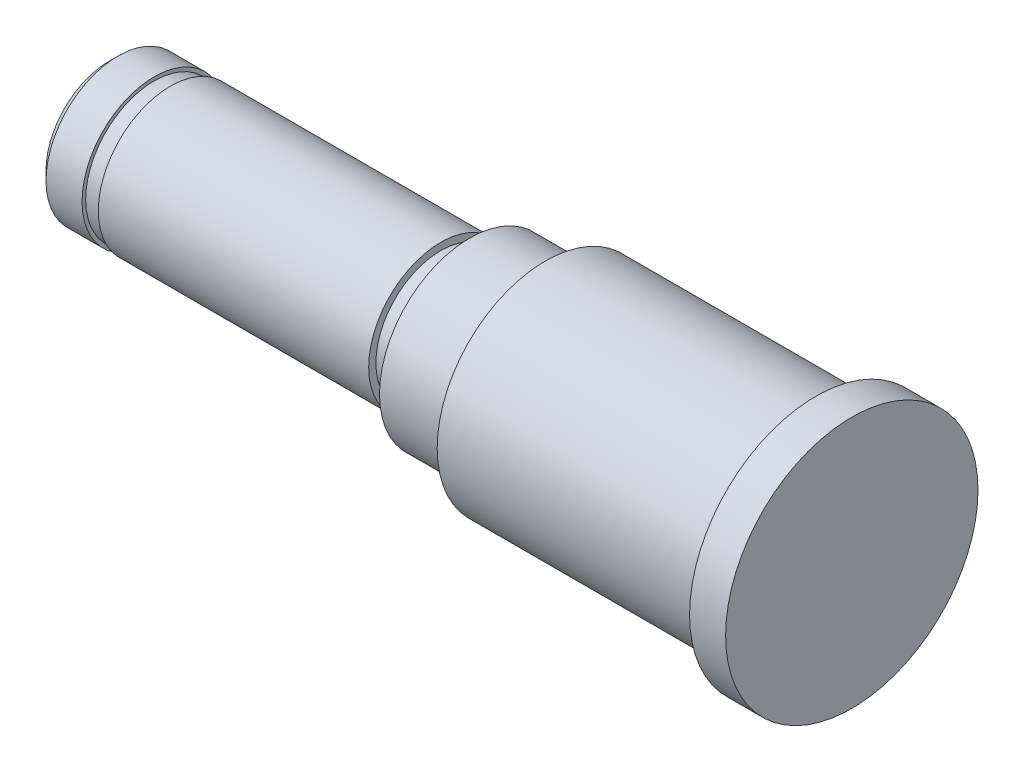
ISO-10303-21;
HEADER;
FILE_DESCRIPTION(('STEP AP214'),'2;1');
FILE_NAME('part.step','',(''),(''),'','','');
FILE_SCHEMA(('AUTOMOTIVE_DESIGN { 1 0 10303 214 1 1 1 1 }'));
ENDSEC;
DATA;
#1=APPLICATION_CONTEXT('core data for automotive mechanical design processes');
#2=APPLICATION_PROTOCOL_DEFINITION('international standard','automotive_design',2000,#1);
#3=PRODUCT_CONTEXT('',#1,'mechanical');
#4=PRODUCT('Part','Part','',(#3));
#5=PRODUCT_RELATED_PRODUCT_CATEGORY('part','',(#4));
#6=PRODUCT_DEFINITION_FORMATION('','',#4);
#7=PRODUCT_DEFINITION_CONTEXT('part definition',#1,'design');
#8=PRODUCT_DEFINITION('design','',#6,#7);
#9=PRODUCT_DEFINITION_SHAPE('','',#8);
#10=(LENGTH_UNIT() NAMED_UNIT(*) SI_UNIT(.MILLI.,.METRE.));
#11=(NAMED_UNIT(*) PLANE_ANGLE_UNIT() SI_UNIT($,.RADIAN.));
#12=(NAMED_UNIT(*) SI_UNIT($,.STERADIAN.) SOLID_ANGLE_UNIT());
#13=UNCERTAINTY_MEASURE_WITH_UNIT(LENGTH_MEASURE(1.E-05),#10,'distance_accuracy_value','');
#14=(GEOMETRIC_REPRESENTATION_CONTEXT(3) GLOBAL_UNCERTAINTY_ASSIGNED_CONTEXT((#13)) GLOBAL_UNIT_ASSIGNED_CONTEXT((#10,
#11,#12)) REPRESENTATION_CONTEXT('',''));
#15=CARTESIAN_POINT('',(0.,0.,0.));
#16=DIRECTION('',(0.,0.,1.));
#17=DIRECTION('',(1.,0.,0.));
#18=AXIS2_PLACEMENT_3D('',#15,#16,#17);
#19=CARTESIAN_POINT('',(-29.713986013986,7.,0.));
#20=DIRECTION('',(-1.,0.,0.));
#21=DIRECTION('',(0.,0.,1.));
#22=AXIS2_PLACEMENT_3D('',#19,#20,#21);
#23=PLANE('',#22);
#24=CARTESIAN_POINT('',(-29.713986013986,0.,0.));
#25=DIRECTION('',(-1.,0.,0.));
#26=DIRECTION('',(0.,0.,1.));
#27=AXIS2_PLACEMENT_3D('',#24,#25,#26);
#28=CIRCLE('',#27,7.);
#29=CARTESIAN_POINT('',(-29.713986013986,0.,7.));
#30=VERTEX_POINT('',#29);
#31=EDGE_CURVE('E13',#30,#30,#28,.T.);
#32=ORIENTED_EDGE('',*,*,#31,.F.);
#33=EDGE_LOOP('',(#32));
#34=FACE_BOUND('',#33,.T.);
#35=ADVANCED_FACE('F57',(#34),#23,.F.);
#36=CARTESIAN_POINT('',(-99.95337995338,0.,0.));
#37=DIRECTION('',(-1.,0.,0.));
#38=DIRECTION('',(0.,0.,1.));
#39=AXIS2_PLACEMENT_3D('',#36,#37,#38);
#40=CYLINDRICAL_SURFACE('',#39,7.);
#41=CARTESIAN_POINT('',(-31.713986013986,0.,0.));
#42=DIRECTION('',(-1.,0.,0.));
#43=DIRECTION('',(0.,0.,1.));
#44=AXIS2_PLACEMENT_3D('',#41,#42,#43);
#45=CIRCLE('',#44,7.);
#46=CARTESIAN_POINT('',(-31.713986013986,0.,7.));
#47=VERTEX_POINT('',#46);
#48=EDGE_CURVE('E63',#47,#47,#45,.T.);
#49=ORIENTED_EDGE('',*,*,#48,.F.);
#50=EDGE_LOOP('',(#49));
#51=FACE_BOUND('',#50,.T.);
#52=ORIENTED_EDGE('',*,*,#31,.T.);
#53=EDGE_LOOP('',(#52));
#54=FACE_BOUND('',#53,.T.);
#55=ADVANCED_FACE('F204',(#51,#54),#40,.T.);
#56=CARTESIAN_POINT('',(-31.713986013986,6.2,0.));
#57=DIRECTION('',(1.,0.,0.));
#58=DIRECTION('',(0.,0.,-1.));
#59=AXIS2_PLACEMENT_3D('',#56,#57,#58);
#60=PLANE('',#59);
#61=CARTESIAN_POINT('',(-31.713986013986,0.,0.));
#62=DIRECTION('',(-1.,0.,0.));
#63=DIRECTION('',(0.,0.,1.));
#64=AXIS2_PLACEMENT_3D('',#61,#62,#63);
#65=CIRCLE('',#64,6.2);
#66=CARTESIAN_POINT('',(-31.713986013986,0.,6.2));
#67=VERTEX_POINT('',#66);
#68=EDGE_CURVE('E67',#67,#67,#65,.T.);
#69=ORIENTED_EDGE('',*,*,#68,.F.);
#70=EDGE_LOOP('',(#69));
#71=FACE_BOUND('',#70,.T.);
#72=ORIENTED_EDGE('',*,*,#48,.T.);
#73=EDGE_LOOP('',(#72));
#74=FACE_BOUND('',#73,.T.);
#75=ADVANCED_FACE('F199',(#71,#74),#60,.F.);
#76=CARTESIAN_POINT('',(-31.913986013986,0.,0.));
#77=DIRECTION('',(-1.,0.,0.));
#78=DIRECTION('',(0.,0.,1.));
#79=AXIS2_PLACEMENT_3D('',#76,#77,#78);
#80=TOROIDAL_SURFACE('',#79,6.2,0.199999999999999);
#81=CARTESIAN_POINT('',(-31.913986013986,0.,0.));
#82=DIRECTION('',(-1.,0.,0.));
#83=DIRECTION('',(0.,0.,1.));
#84=AXIS2_PLACEMENT_3D('',#81,#82,#83);
#85=CIRCLE('',#84,6.);
#86=CARTESIAN_POINT('',(-31.913986013986,0.,6.));
#87=VERTEX_POINT('',#86);
#88=EDGE_CURVE('E71',#87,#87,#85,.T.);
#89=ORIENTED_EDGE('',*,*,#88,.F.);
#90=EDGE_LOOP('',(#89));
#91=FACE_BOUND('',#90,.T.);
#92=ORIENTED_EDGE('',*,*,#68,.T.);
#93=EDGE_LOOP('',(#92));
#94=FACE_BOUND('',#93,.T.);
#95=ADVANCED_FACE('F193',(#91,#94),#80,.F.);
#96=CARTESIAN_POINT('',(-99.95337995338,0.,0.));
#97=DIRECTION('',(-1.,0.,0.));
#98=DIRECTION('',(0.,0.,1.));
#99=AXIS2_PLACEMENT_3D('',#96,#97,#98);
#100=CYLINDRICAL_SURFACE('',#99,6.);
#101=CARTESIAN_POINT('',(-46.713986013986,0.,0.));
#102=DIRECTION('',(-1.,0.,0.));
#103=DIRECTION('',(0.,0.,1.));
#104=AXIS2_PLACEMENT_3D('',#101,#102,#103);
#105=CIRCLE('',#104,6.);
#106=CARTESIAN_POINT('',(-46.713986013986,0.,6.));
#107=VERTEX_POINT('',#106);
#108=EDGE_CURVE('E76',#107,#107,#105,.T.);
#109=ORIENTED_EDGE('',*,*,#108,.F.);
#110=EDGE_LOOP('',(#109));
#111=FACE_BOUND('',#110,.T.);
#112=ORIENTED_EDGE('',*,*,#88,.T.);
#113=EDGE_LOOP('',(#112));
#114=FACE_BOUND('',#113,.T.);
#115=ADVANCED_FACE('F187',(#111,#114),#100,.T.);
#116=CARTESIAN_POINT('',(-46.713986013986,5.2,0.));
#117=DIRECTION('',(1.,0.,0.));
#118=DIRECTION('',(0.,0.,-1.));
#119=AXIS2_PLACEMENT_3D('',#116,#117,#118);
#120=PLANE('',#119);
#121=CARTESIAN_POINT('',(-46.713986013986,0.,0.));
#122=DIRECTION('',(-1.,0.,0.));
#123=DIRECTION('',(0.,0.,1.));
#124=AXIS2_PLACEMENT_3D('',#121,#122,#123);
#125=CIRCLE('',#124,5.2);
#126=CARTESIAN_POINT('',(-46.713986013986,0.,5.2));
#127=VERTEX_POINT('',#126);
#128=EDGE_CURVE('E79',#127,#127,#125,.T.);
#129=ORIENTED_EDGE('',*,*,#128,.F.);
#130=EDGE_LOOP('',(#129));
#131=FACE_BOUND('',#130,.T.);
#132=ORIENTED_EDGE('',*,*,#108,.T.);
#133=EDGE_LOOP('',(#132));
#134=FACE_BOUND('',#133,.T.);
#135=ADVANCED_FACE('F181',(#131,#134),#120,.F.);
#136=CARTESIAN_POINT('',(-46.913986013986,0.,0.));
#137=DIRECTION('',(-1.,0.,0.));
#138=DIRECTION('',(0.,0.,1.));
#139=AXIS2_PLACEMENT_3D('',#136,#137,#138);
#140=TOROIDAL_SURFACE('',#139,5.2,0.199999999999999);
#141=CARTESIAN_POINT('',(-46.913986013986,0.,0.));
#142=DIRECTION('',(-1.,0.,0.));
#143=DIRECTION('',(0.,0.,1.));
#144=AXIS2_PLACEMENT_3D('',#141,#142,#143);
#145=CIRCLE('',#144,5.);
#146=CARTESIAN_POINT('',(-46.913986013986,0.,5.));
#147=VERTEX_POINT('',#146);
#148=EDGE_CURVE('E82',#147,#147,#145,.T.);
#149=ORIENTED_EDGE('',*,*,#148,.F.);
#150=EDGE_LOOP('',(#149));
#151=FACE_BOUND('',#150,.T.);
#152=ORIENTED_EDGE('',*,*,#128,.T.);
#153=EDGE_LOOP('',(#152));
#154=FACE_BOUND('',#153,.T.);
#155=ADVANCED_FACE('F175',(#151,#154),#140,.F.);
#156=CARTESIAN_POINT('',(-99.95337995338,0.,0.));
#157=DIRECTION('',(-1.,0.,0.));
#158=DIRECTION('',(0.,0.,1.));
#159=AXIS2_PLACEMENT_3D('',#156,#157,#158);
#160=CYLINDRICAL_SURFACE('',#159,5.);
#161=CARTESIAN_POINT('',(-50.913986013986,0.,0.));
#162=DIRECTION('',(-1.,0.,0.));
#163=DIRECTION('',(0.,0.,1.));
#164=AXIS2_PLACEMENT_3D('',#161,#162,#163);
#165=CIRCLE('',#164,5.);
#166=CARTESIAN_POINT('',(-50.913986013986,0.,5.));
#167=VERTEX_POINT('',#166);
#168=EDGE_CURVE('E85',#167,#167,#165,.T.);
#169=ORIENTED_EDGE('',*,*,#168,.F.);
#170=EDGE_LOOP('',(#169));
#171=FACE_BOUND('',#170,.T.);
#172=ORIENTED_EDGE('',*,*,#148,.T.);
#173=EDGE_LOOP('',(#172));
#174=FACE_BOUND('',#173,.T.);
#175=ADVANCED_FACE('F169',(#171,#174),#160,.T.);
#176=CARTESIAN_POINT('',(-50.913986013986,3.6,0.));
#177=DIRECTION('',(1.,0.,0.));
#178=DIRECTION('',(0.,0.,-1.));
#179=AXIS2_PLACEMENT_3D('',#176,#177,#178);
#180=PLANE('',#179);
#181=CARTESIAN_POINT('',(-50.913986013986,0.,0.));
#182=DIRECTION('',(-1.,0.,0.));
#183=DIRECTION('',(0.,0.,1.));
#184=AXIS2_PLACEMENT_3D('',#181,#182,#183);
#185=CIRCLE('',#184,3.6);
#186=CARTESIAN_POINT('',(-50.913986013986,0.,3.6));
#187=VERTEX_POINT('',#186);
#188=EDGE_CURVE('E88',#187,#187,#185,.T.);
#189=ORIENTED_EDGE('',*,*,#188,.F.);
#190=EDGE_LOOP('',(#189));
#191=FACE_BOUND('',#190,.T.);
#192=ORIENTED_EDGE('',*,*,#168,.T.);
#193=EDGE_LOOP('',(#192));
#194=FACE_BOUND('',#193,.T.);
#195=ADVANCED_FACE('F163',(#191,#194),#180,.F.);
#196=CARTESIAN_POINT('',(-99.95337995338,0.,0.));
#197=DIRECTION('',(-1.,0.,0.));
#198=DIRECTION('',(0.,0.,1.));
#199=AXIS2_PLACEMENT_3D('',#196,#197,#198);
#200=CYLINDRICAL_SURFACE('',#199,3.6);
#201=CARTESIAN_POINT('',(-52.513986013986,0.,0.));
#202=DIRECTION('',(-1.,0.,0.));
#203=DIRECTION('',(0.,0.,1.));
#204=AXIS2_PLACEMENT_3D('',#201,#202,#203);
#205=CIRCLE('',#204,3.6);
#206=CARTESIAN_POINT('',(-52.513986013986,0.,3.6));
#207=VERTEX_POINT('',#206);
#208=EDGE_CURVE('E91',#207,#207,#205,.T.);
#209=ORIENTED_EDGE('',*,*,#208,.F.);
#210=EDGE_LOOP('',(#209));
#211=FACE_BOUND('',#210,.T.);
#212=ORIENTED_EDGE('',*,*,#188,.T.);
#213=EDGE_LOOP('',(#212));
#214=FACE_BOUND('',#213,.T.);
#215=ADVANCED_FACE('F157',(#211,#214),#200,.T.);
#216=CARTESIAN_POINT('',(-52.513986013986,4.,0.));
#217=DIRECTION('',(-1.,0.,0.));
#218=DIRECTION('',(0.,0.,1.));
#219=AXIS2_PLACEMENT_3D('',#216,#217,#218);
#220=PLANE('',#219);
#221=CARTESIAN_POINT('',(-52.513986013986,0.,0.));
#222=DIRECTION('',(-1.,0.,0.));
#223=DIRECTION('',(0.,0.,1.));
#224=AXIS2_PLACEMENT_3D('',#221,#222,#223);
#225=CIRCLE('',#224,4.);
#226=CARTESIAN_POINT('',(-52.513986013986,0.,4.));
#227=VERTEX_POINT('',#226);
#228=EDGE_CURVE('E94',#227,#227,#225,.T.);
#229=ORIENTED_EDGE('',*,*,#228,.F.);
#230=EDGE_LOOP('',(#229));
#231=FACE_BOUND('',#230,.T.);
#232=ORIENTED_EDGE('',*,*,#208,.T.);
#233=EDGE_LOOP('',(#232));
#234=FACE_BOUND('',#233,.T.);
#235=ADVANCED_FACE('F151',(#231,#234),#220,.F.);
#236=CARTESIAN_POINT('',(-99.95337995338,0.,0.));
#237=DIRECTION('',(-1.,0.,0.));
#238=DIRECTION('',(0.,0.,1.));
#239=AXIS2_PLACEMENT_3D('',#236,#237,#238);
#240=CYLINDRICAL_SURFACE('',#239,4.);
#241=CARTESIAN_POINT('',(-67.513986013986,0.,0.));
#242=DIRECTION('',(-1.,0.,0.));
#243=DIRECTION('',(0.,0.,1.));
#244=AXIS2_PLACEMENT_3D('',#241,#242,#243);
#245=CIRCLE('',#244,4.);
#246=CARTESIAN_POINT('',(-67.513986013986,0.,4.));
#247=VERTEX_POINT('',#246);
#248=EDGE_CURVE('E97',#247,#247,#245,.T.);
#249=ORIENTED_EDGE('',*,*,#248,.F.);
#250=EDGE_LOOP('',(#249));
#251=FACE_BOUND('',#250,.T.);
#252=ORIENTED_EDGE('',*,*,#228,.T.);
#253=EDGE_LOOP('',(#252));
#254=FACE_BOUND('',#253,.T.);
#255=ADVANCED_FACE('F145',(#251,#254),#240,.T.);
#256=CARTESIAN_POINT('',(-67.513986013986,4.,0.));
#257=DIRECTION('',(1.,0.,0.));
#258=DIRECTION('',(0.,0.,-1.));
#259=AXIS2_PLACEMENT_3D('',#256,#257,#258);
#260=PLANE('',#259);
#261=CARTESIAN_POINT('',(-67.513986013986,0.,0.));
#262=DIRECTION('',(-1.,0.,0.));
#263=DIRECTION('',(0.,0.,1.));
#264=AXIS2_PLACEMENT_3D('',#261,#262,#263);
#265=CIRCLE('',#264,3.8);
#266=CARTESIAN_POINT('',(-67.513986013986,0.,3.8));
#267=VERTEX_POINT('',#266);
#268=EDGE_CURVE('E100',#267,#267,#265,.T.);
#269=ORIENTED_EDGE('',*,*,#268,.F.);
#270=EDGE_LOOP('',(#269));
#271=FACE_BOUND('',#270,.T.);
#272=ORIENTED_EDGE('',*,*,#248,.T.);
#273=EDGE_LOOP('',(#272));
#274=FACE_BOUND('',#273,.T.);
#275=ADVANCED_FACE('F139',(#271,#274),#260,.F.);
#276=CARTESIAN_POINT('',(-99.95337995338,0.,0.));
#277=DIRECTION('',(-1.,0.,0.));
#278=DIRECTION('',(0.,0.,1.));
#279=AXIS2_PLACEMENT_3D('',#276,#277,#278);
#280=CYLINDRICAL_SURFACE('',#279,3.8);
#281=CARTESIAN_POINT('',(-68.413986013986,0.,0.));
#282=DIRECTION('',(-1.,0.,0.));
#283=DIRECTION('',(0.,0.,1.));
#284=AXIS2_PLACEMENT_3D('',#281,#282,#283);
#285=CIRCLE('',#284,3.8);
#286=CARTESIAN_POINT('',(-68.413986013986,0.,3.8));
#287=VERTEX_POINT('',#286);
#288=EDGE_CURVE('E103',#287,#287,#285,.T.);
#289=ORIENTED_EDGE('',*,*,#288,.F.);
#290=EDGE_LOOP('',(#289));
#291=FACE_BOUND('',#290,.T.);
#292=ORIENTED_EDGE('',*,*,#268,.T.);
#293=EDGE_LOOP('',(#292));
#294=FACE_BOUND('',#293,.T.);
#295=ADVANCED_FACE('F133',(#291,#294),#280,.T.);
#296=CARTESIAN_POINT('',(-68.413986013986,4.,0.));
#297=DIRECTION('',(-1.,0.,0.));
#298=DIRECTION('',(0.,0.,1.));
#299=AXIS2_PLACEMENT_3D('',#296,#297,#298);
#300=PLANE('',#299);
#301=CARTESIAN_POINT('',(-68.413986013986,0.,0.));
#302=DIRECTION('',(-1.,0.,0.));
#303=DIRECTION('',(0.,0.,1.));
#304=AXIS2_PLACEMENT_3D('',#301,#302,#303);
#305=CIRCLE('',#304,4.);
#306=CARTESIAN_POINT('',(-68.413986013986,0.,4.));
#307=VERTEX_POINT('',#306);
#308=EDGE_CURVE('E106',#307,#307,#305,.T.);
#309=ORIENTED_EDGE('',*,*,#308,.F.);
#310=EDGE_LOOP('',(#309));
#311=FACE_BOUND('',#310,.T.);
#312=ORIENTED_EDGE('',*,*,#288,.T.);
#313=EDGE_LOOP('',(#312));
#314=FACE_BOUND('',#313,.T.);
#315=ADVANCED_FACE('F127',(#311,#314),#300,.F.);
#316=CARTESIAN_POINT('',(-99.95337995338,0.,0.));
#317=DIRECTION('',(-1.,0.,0.));
#318=DIRECTION('',(0.,0.,1.));
#319=AXIS2_PLACEMENT_3D('',#316,#317,#318);
#320=CYLINDRICAL_SURFACE('',#319,4.);
#321=CARTESIAN_POINT('',(-70.4137360124235,0.,0.));
#322=DIRECTION('',(-1.,0.,0.));
#323=DIRECTION('',(0.,0.,1.));
#324=AXIS2_PLACEMENT_3D('',#321,#322,#323);
#325=CIRCLE('',#324,4.);
#326=CARTESIAN_POINT('',(-70.4137360124235,0.,4.));
#327=VERTEX_POINT('',#326);
#328=EDGE_CURVE('E109',#327,#327,#325,.T.);
#329=ORIENTED_EDGE('',*,*,#328,.F.);
#330=EDGE_LOOP('',(#329));
#331=FACE_BOUND('',#330,.T.);
#332=ORIENTED_EDGE('',*,*,#308,.T.);
#333=EDGE_LOOP('',(#332));
#334=FACE_BOUND('',#333,.T.);
#335=ADVANCED_FACE('F121',(#331,#334),#320,.T.);
#336=CARTESIAN_POINT('',(-70.4137360124235,0.,0.));
#337=DIRECTION('',(1.,0.,0.));
#338=DIRECTION('',(0.,0.,-1.));
#339=AXIS2_PLACEMENT_3D('',#336,#337,#338);
#340=CONICAL_SURFACE('',#339,4.,0.785398163397448);
#341=CARTESIAN_POINT('',(-70.9137360124235,0.,0.));
#342=DIRECTION('',(-1.,0.,0.));
#343=DIRECTION('',(0.,0.,1.));
#344=AXIS2_PLACEMENT_3D('',#341,#342,#343);
#345=CIRCLE('',#344,3.5);
#346=CARTESIAN_POINT('',(-70.9137360124235,0.,3.5));
#347=VERTEX_POINT('',#346);
#348=EDGE_CURVE('E112',#347,#347,#345,.T.);
#349=ORIENTED_EDGE('',*,*,#348,.F.);
#350=EDGE_LOOP('',(#349));
#351=FACE_BOUND('',#350,.T.);
#352=ORIENTED_EDGE('',*,*,#328,.T.);
#353=EDGE_LOOP('',(#352));
#354=FACE_BOUND('',#353,.T.);
#355=ADVANCED_FACE('F118',(#351,#354),#340,.T.);
#356=CARTESIAN_POINT('',(-70.9137360124235,0.,0.));
#357=DIRECTION('',(1.,0.,0.));
#358=DIRECTION('',(0.,0.,-1.));
#359=AXIS2_PLACEMENT_3D('',#356,#357,#358);
#360=PLANE('',#359);
#361=ORIENTED_EDGE('',*,*,#348,.T.);
#362=EDGE_LOOP('',(#361));
#363=FACE_BOUND('',#362,.T.);
#364=ADVANCED_FACE('F116',(#363),#360,.F.);
#365=CLOSED_SHELL('',(#35,#55,#75,#95,#115,#135,#155,#175,#195,#215,#235,#255,#275,#295,#315,
#335,#355,#364));
#366=MANIFOLD_SOLID_BREP('B2',#365);
#367=ADVANCED_BREP_SHAPE_REPRESENTATION('',(#18,#366),#14);
#368=SHAPE_DEFINITION_REPRESENTATION(#9,#367);
ENDSEC;
END-ISO-10303-21;
